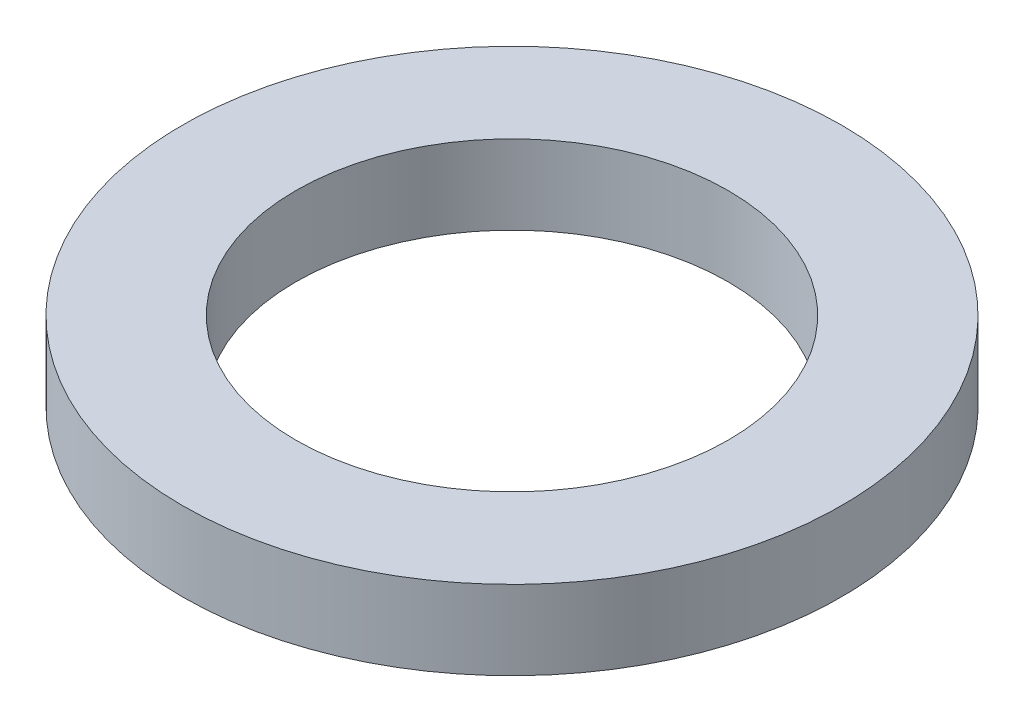
ISO-10303-21;
HEADER;
FILE_DESCRIPTION(('STEP AP214'),'2;1');
FILE_NAME('part.step','',(''),(''),'','','');
FILE_SCHEMA(('AUTOMOTIVE_DESIGN { 1 0 10303 214 1 1 1 1 }'));
ENDSEC;
DATA;
#1=APPLICATION_CONTEXT('core data for automotive mechanical design processes');
#2=APPLICATION_PROTOCOL_DEFINITION('international standard','automotive_design',2000,#1);
#3=PRODUCT_CONTEXT('',#1,'mechanical');
#4=PRODUCT('Part','Part','',(#3));
#5=PRODUCT_RELATED_PRODUCT_CATEGORY('part','',(#4));
#6=PRODUCT_DEFINITION_FORMATION('','',#4);
#7=PRODUCT_DEFINITION_CONTEXT('part definition',#1,'design');
#8=PRODUCT_DEFINITION('design','',#6,#7);
#9=PRODUCT_DEFINITION_SHAPE('','',#8);
#10=(LENGTH_UNIT() NAMED_UNIT(*) SI_UNIT(.MILLI.,.METRE.));
#11=(NAMED_UNIT(*) PLANE_ANGLE_UNIT() SI_UNIT($,.RADIAN.));
#12=(NAMED_UNIT(*) SI_UNIT($,.STERADIAN.) SOLID_ANGLE_UNIT());
#13=UNCERTAINTY_MEASURE_WITH_UNIT(LENGTH_MEASURE(1.E-05),#10,'distance_accuracy_value','');
#14=(GEOMETRIC_REPRESENTATION_CONTEXT(3) GLOBAL_UNCERTAINTY_ASSIGNED_CONTEXT((#13)) GLOBAL_UNIT_ASSIGNED_CONTEXT((#10,
#11,#12)) REPRESENTATION_CONTEXT('',''));
#15=CARTESIAN_POINT('',(0.,0.,0.));
#16=DIRECTION('',(0.,0.,1.));
#17=DIRECTION('',(1.,0.,0.));
#18=AXIS2_PLACEMENT_3D('',#15,#16,#17);
#19=CARTESIAN_POINT('',(0.,6.,0.));
#20=DIRECTION('',(0.,-1.,0.));
#21=DIRECTION('',(0.,0.,-1.));
#22=AXIS2_PLACEMENT_3D('',#19,#20,#21);
#23=CYLINDRICAL_SURFACE('',#22,25.);
#24=CARTESIAN_POINT('',(0.,6.,0.));
#25=DIRECTION('',(0.,1.,0.));
#26=DIRECTION('',(0.,0.,1.));
#27=AXIS2_PLACEMENT_3D('',#24,#25,#26);
#28=CIRCLE('',#27,25.);
#29=CARTESIAN_POINT('',(0.,6.,25.));
#30=VERTEX_POINT('',#29);
#31=EDGE_CURVE('E10',#30,#30,#28,.T.);
#32=ORIENTED_EDGE('',*,*,#31,.F.);
#33=EDGE_LOOP('',(#32));
#34=FACE_BOUND('',#33,.T.);
#35=CARTESIAN_POINT('',(0.,0.,0.));
#36=DIRECTION('',(0.,1.,0.));
#37=DIRECTION('',(0.,0.,1.));
#38=AXIS2_PLACEMENT_3D('',#35,#36,#37);
#39=CIRCLE('',#38,25.);
#40=CARTESIAN_POINT('',(0.,0.,25.));
#41=VERTEX_POINT('',#40);
#42=EDGE_CURVE('E34',#41,#41,#39,.T.);
#43=ORIENTED_EDGE('',*,*,#42,.T.);
#44=EDGE_LOOP('',(#43));
#45=FACE_BOUND('',#44,.T.);
#46=ADVANCED_FACE('F31',(#34,#45),#23,.T.);
#47=CARTESIAN_POINT('',(0.,6.,0.));
#48=DIRECTION('',(0.,1.,0.));
#49=DIRECTION('',(0.,0.,1.));
#50=AXIS2_PLACEMENT_3D('',#47,#48,#49);
#51=PLANE('',#50);
#52=CARTESIAN_POINT('',(0.,6.,0.));
#53=DIRECTION('',(0.,1.,0.));
#54=DIRECTION('',(0.,0.,1.));
#55=AXIS2_PLACEMENT_3D('',#52,#53,#54);
#56=CIRCLE('',#55,16.4);
#57=CARTESIAN_POINT('',(0.,6.,16.4));
#58=VERTEX_POINT('',#57);
#59=EDGE_CURVE('E43',#58,#58,#56,.T.);
#60=ORIENTED_EDGE('',*,*,#59,.F.);
#61=EDGE_LOOP('',(#60));
#62=FACE_BOUND('',#61,.T.);
#63=ORIENTED_EDGE('',*,*,#31,.T.);
#64=EDGE_LOOP('',(#63));
#65=FACE_BOUND('',#64,.T.);
#66=ADVANCED_FACE('F58',(#62,#65),#51,.T.);
#67=CARTESIAN_POINT('',(0.,0.,0.));
#68=DIRECTION('',(0.,1.,0.));
#69=DIRECTION('',(0.,0.,1.));
#70=AXIS2_PLACEMENT_3D('',#67,#68,#69);
#71=PLANE('',#70);
#72=CARTESIAN_POINT('',(0.,0.,0.));
#73=DIRECTION('',(0.,1.,0.));
#74=DIRECTION('',(0.,0.,1.));
#75=AXIS2_PLACEMENT_3D('',#72,#73,#74);
#76=CIRCLE('',#75,16.4);
#77=CARTESIAN_POINT('',(0.,0.,16.4));
#78=VERTEX_POINT('',#77);
#79=EDGE_CURVE('E41',#78,#78,#76,.T.);
#80=ORIENTED_EDGE('',*,*,#79,.T.);
#81=EDGE_LOOP('',(#80));
#82=FACE_BOUND('',#81,.T.);
#83=ORIENTED_EDGE('',*,*,#42,.F.);
#84=EDGE_LOOP('',(#83));
#85=FACE_BOUND('',#84,.T.);
#86=ADVANCED_FACE('F49',(#82,#85),#71,.F.);
#87=CARTESIAN_POINT('',(0.,0.,0.));
#88=DIRECTION('',(0.,1.,0.));
#89=DIRECTION('',(0.,0.,1.));
#90=AXIS2_PLACEMENT_3D('',#87,#88,#89);
#91=CYLINDRICAL_SURFACE('',#90,16.4);
#92=ORIENTED_EDGE('',*,*,#79,.F.);
#93=EDGE_LOOP('',(#92));
#94=FACE_BOUND('',#93,.T.);
#95=ORIENTED_EDGE('',*,*,#59,.T.);
#96=EDGE_LOOP('',(#95));
#97=FACE_BOUND('',#96,.T.);
#98=ADVANCED_FACE('F52',(#94,#97),#91,.F.);
#99=CLOSED_SHELL('',(#46,#66,#86,#98));
#100=MANIFOLD_SOLID_BREP('B2',#99);
#101=ADVANCED_BREP_SHAPE_REPRESENTATION('',(#18,#100),#14);
#102=SHAPE_DEFINITION_REPRESENTATION(#9,#101);
ENDSEC;
END-ISO-10303-21;
